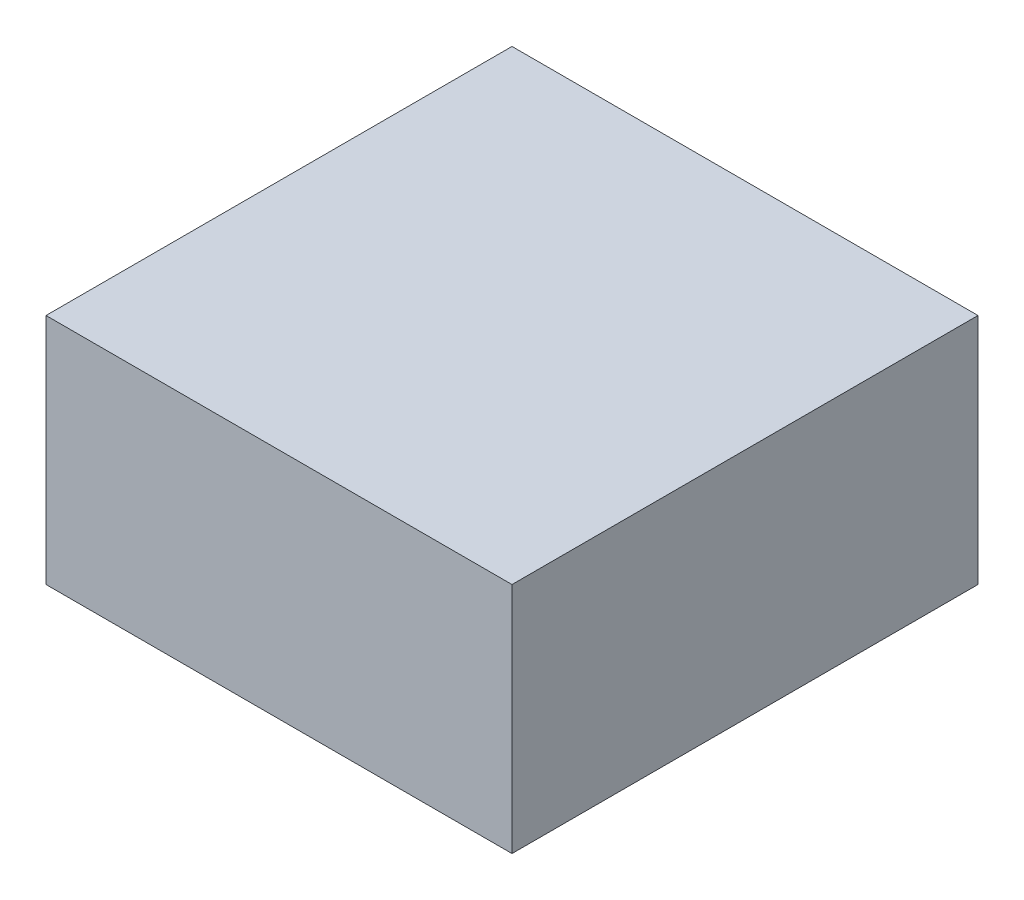
ISO-10303-21;
HEADER;
FILE_DESCRIPTION(('STEP AP214'),'2;1');
FILE_NAME('part.step','',(''),(''),'','','');
FILE_SCHEMA(('AUTOMOTIVE_DESIGN { 1 0 10303 214 1 1 1 1 }'));
ENDSEC;
DATA;
#1=APPLICATION_CONTEXT('core data for automotive mechanical design processes');
#2=APPLICATION_PROTOCOL_DEFINITION('international standard','automotive_design',2000,#1);
#3=PRODUCT_CONTEXT('',#1,'mechanical');
#4=PRODUCT('Part','Part','',(#3));
#5=PRODUCT_RELATED_PRODUCT_CATEGORY('part','',(#4));
#6=PRODUCT_DEFINITION_FORMATION('','',#4);
#7=PRODUCT_DEFINITION_CONTEXT('part definition',#1,'design');
#8=PRODUCT_DEFINITION('design','',#6,#7);
#9=PRODUCT_DEFINITION_SHAPE('','',#8);
#10=(LENGTH_UNIT() NAMED_UNIT(*) SI_UNIT(.MILLI.,.METRE.));
#11=(NAMED_UNIT(*) PLANE_ANGLE_UNIT() SI_UNIT($,.RADIAN.));
#12=(NAMED_UNIT(*) SI_UNIT($,.STERADIAN.) SOLID_ANGLE_UNIT());
#13=UNCERTAINTY_MEASURE_WITH_UNIT(LENGTH_MEASURE(1.E-05),#10,'distance_accuracy_value','');
#14=(GEOMETRIC_REPRESENTATION_CONTEXT(3) GLOBAL_UNCERTAINTY_ASSIGNED_CONTEXT((#13)) GLOBAL_UNIT_ASSIGNED_CONTEXT((#10,
#11,#12)) REPRESENTATION_CONTEXT('',''));
#15=CARTESIAN_POINT('',(0.,0.,0.));
#16=DIRECTION('',(0.,0.,1.));
#17=DIRECTION('',(1.,0.,0.));
#18=AXIS2_PLACEMENT_3D('',#15,#16,#17);
#19=CARTESIAN_POINT('',(0.,9.,0.));
#20=DIRECTION('',(1.,0.,0.));
#21=DIRECTION('',(0.,0.,-1.));
#22=AXIS2_PLACEMENT_3D('',#19,#20,#21);
#23=PLANE('',#22);
#24=DIRECTION('',(0.,0.,1.));
#25=VECTOR('',#24,1.);
#26=CARTESIAN_POINT('',(0.,0.,0.));
#27=LINE('',#26,#25);
#28=CARTESIAN_POINT('',(0.,0.,-18.));
#29=VERTEX_POINT('',#28);
#30=CARTESIAN_POINT('',(0.,0.,0.));
#31=VERTEX_POINT('',#30);
#32=EDGE_CURVE('E111',#29,#31,#27,.T.);
#33=ORIENTED_EDGE('',*,*,#32,.T.);
#34=DIRECTION('',(0.,-1.,0.));
#35=VECTOR('',#34,1.);
#36=CARTESIAN_POINT('',(0.,9.,0.));
#37=LINE('',#36,#35);
#38=CARTESIAN_POINT('',(0.,9.,0.));
#39=VERTEX_POINT('',#38);
#40=EDGE_CURVE('E11',#39,#31,#37,.T.);
#41=ORIENTED_EDGE('',*,*,#40,.F.);
#42=DIRECTION('',(0.,0.,1.));
#43=VECTOR('',#42,1.);
#44=CARTESIAN_POINT('',(0.,9.,0.));
#45=LINE('',#44,#43);
#46=CARTESIAN_POINT('',(0.,9.,-18.));
#47=VERTEX_POINT('',#46);
#48=EDGE_CURVE('E95',#47,#39,#45,.T.);
#49=ORIENTED_EDGE('',*,*,#48,.F.);
#50=DIRECTION('',(0.,-1.,0.));
#51=VECTOR('',#50,1.);
#52=CARTESIAN_POINT('',(0.,9.,-18.));
#53=LINE('',#52,#51);
#54=EDGE_CURVE('E107',#47,#29,#53,.T.);
#55=ORIENTED_EDGE('',*,*,#54,.T.);
#56=EDGE_LOOP('',(#33,#41,#49,#55));
#57=FACE_BOUND('',#56,.T.);
#58=ADVANCED_FACE('F43',(#57),#23,.F.);
#59=CARTESIAN_POINT('',(0.,9.,0.));
#60=DIRECTION('',(0.,0.,-1.));
#61=DIRECTION('',(-1.,0.,0.));
#62=AXIS2_PLACEMENT_3D('',#59,#60,#61);
#63=PLANE('',#62);
#64=DIRECTION('',(1.,0.,0.));
#65=VECTOR('',#64,1.);
#66=CARTESIAN_POINT('',(0.,0.,0.));
#67=LINE('',#66,#65);
#68=CARTESIAN_POINT('',(18.,0.,0.));
#69=VERTEX_POINT('',#68);
#70=EDGE_CURVE('E100',#31,#69,#67,.T.);
#71=ORIENTED_EDGE('',*,*,#70,.T.);
#72=DIRECTION('',(0.,-1.,0.));
#73=VECTOR('',#72,1.);
#74=CARTESIAN_POINT('',(18.,9.,0.));
#75=LINE('',#74,#73);
#76=CARTESIAN_POINT('',(18.,9.,0.));
#77=VERTEX_POINT('',#76);
#78=EDGE_CURVE('E52',#77,#69,#75,.T.);
#79=ORIENTED_EDGE('',*,*,#78,.F.);
#80=DIRECTION('',(1.,0.,0.));
#81=VECTOR('',#80,1.);
#82=CARTESIAN_POINT('',(0.,9.,0.));
#83=LINE('',#82,#81);
#84=EDGE_CURVE('E90',#39,#77,#83,.T.);
#85=ORIENTED_EDGE('',*,*,#84,.F.);
#86=ORIENTED_EDGE('',*,*,#40,.T.);
#87=EDGE_LOOP('',(#71,#79,#85,#86));
#88=FACE_BOUND('',#87,.T.);
#89=ADVANCED_FACE('F99',(#88),#63,.F.);
#90=CARTESIAN_POINT('',(18.,9.,0.));
#91=DIRECTION('',(-1.,0.,0.));
#92=DIRECTION('',(0.,0.,1.));
#93=AXIS2_PLACEMENT_3D('',#90,#91,#92);
#94=PLANE('',#93);
#95=DIRECTION('',(0.,0.,-1.));
#96=VECTOR('',#95,1.);
#97=CARTESIAN_POINT('',(18.,0.,0.));
#98=LINE('',#97,#96);
#99=CARTESIAN_POINT('',(18.,0.,-18.));
#100=VERTEX_POINT('',#99);
#101=EDGE_CURVE('E77',#69,#100,#98,.T.);
#102=ORIENTED_EDGE('',*,*,#101,.T.);
#103=DIRECTION('',(0.,-1.,0.));
#104=VECTOR('',#103,1.);
#105=CARTESIAN_POINT('',(18.,9.,-18.));
#106=LINE('',#105,#104);
#107=CARTESIAN_POINT('',(18.,9.,-18.));
#108=VERTEX_POINT('',#107);
#109=EDGE_CURVE('E102',#108,#100,#106,.T.);
#110=ORIENTED_EDGE('',*,*,#109,.F.);
#111=DIRECTION('',(0.,0.,-1.));
#112=VECTOR('',#111,1.);
#113=CARTESIAN_POINT('',(18.,9.,0.));
#114=LINE('',#113,#112);
#115=EDGE_CURVE('E93',#77,#108,#114,.T.);
#116=ORIENTED_EDGE('',*,*,#115,.F.);
#117=ORIENTED_EDGE('',*,*,#78,.T.);
#118=EDGE_LOOP('',(#102,#110,#116,#117));
#119=FACE_BOUND('',#118,.T.);
#120=ADVANCED_FACE('F103',(#119),#94,.F.);
#121=CARTESIAN_POINT('',(0.,9.,-18.));
#122=DIRECTION('',(0.,0.,1.));
#123=DIRECTION('',(1.,0.,0.));
#124=AXIS2_PLACEMENT_3D('',#121,#122,#123);
#125=PLANE('',#124);
#126=DIRECTION('',(-1.,0.,0.));
#127=VECTOR('',#126,1.);
#128=CARTESIAN_POINT('',(0.,0.,-18.));
#129=LINE('',#128,#127);
#130=EDGE_CURVE('E83',#100,#29,#129,.T.);
#131=ORIENTED_EDGE('',*,*,#130,.T.);
#132=ORIENTED_EDGE('',*,*,#54,.F.);
#133=DIRECTION('',(-1.,0.,0.));
#134=VECTOR('',#133,1.);
#135=CARTESIAN_POINT('',(0.,9.,-18.));
#136=LINE('',#135,#134);
#137=EDGE_CURVE('E60',#108,#47,#136,.T.);
#138=ORIENTED_EDGE('',*,*,#137,.F.);
#139=ORIENTED_EDGE('',*,*,#109,.T.);
#140=EDGE_LOOP('',(#131,#132,#138,#139));
#141=FACE_BOUND('',#140,.T.);
#142=ADVANCED_FACE('F124',(#141),#125,.F.);
#143=CARTESIAN_POINT('',(0.,9.,0.));
#144=DIRECTION('',(0.,-1.,0.));
#145=DIRECTION('',(0.,0.,-1.));
#146=AXIS2_PLACEMENT_3D('',#143,#144,#145);
#147=PLANE('',#146);
#148=ORIENTED_EDGE('',*,*,#48,.T.);
#149=ORIENTED_EDGE('',*,*,#84,.T.);
#150=ORIENTED_EDGE('',*,*,#115,.T.);
#151=ORIENTED_EDGE('',*,*,#137,.T.);
#152=EDGE_LOOP('',(#148,#149,#150,#151));
#153=FACE_BOUND('',#152,.T.);
#154=ADVANCED_FACE('F91',(#153),#147,.F.);
#155=CARTESIAN_POINT('',(0.,0.,0.));
#156=DIRECTION('',(0.,-1.,0.));
#157=DIRECTION('',(0.,0.,-1.));
#158=AXIS2_PLACEMENT_3D('',#155,#156,#157);
#159=PLANE('',#158);
#160=ORIENTED_EDGE('',*,*,#32,.F.);
#161=ORIENTED_EDGE('',*,*,#130,.F.);
#162=ORIENTED_EDGE('',*,*,#101,.F.);
#163=ORIENTED_EDGE('',*,*,#70,.F.);
#164=EDGE_LOOP('',(#160,#161,#162,#163));
#165=FACE_BOUND('',#164,.T.);
#166=ADVANCED_FACE('F127',(#165),#159,.T.);
#167=CLOSED_SHELL('',(#58,#89,#120,#142,#154,#166));
#168=MANIFOLD_SOLID_BREP('B2',#167);
#169=ADVANCED_BREP_SHAPE_REPRESENTATION('',(#18,#168),#14);
#170=SHAPE_DEFINITION_REPRESENTATION(#9,#169);
ENDSEC;
END-ISO-10303-21;
